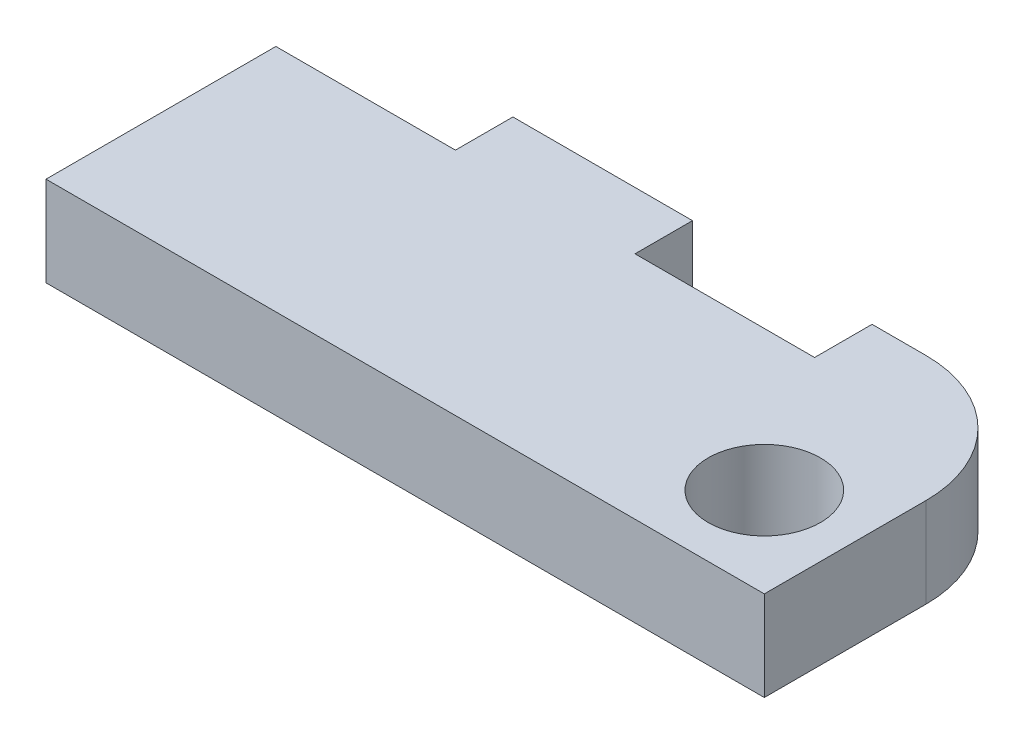
ISO-10303-21;
HEADER;
FILE_DESCRIPTION(('STEP AP214'),'2;1');
FILE_NAME('part.step','',(''),(''),'','','');
FILE_SCHEMA(('AUTOMOTIVE_DESIGN { 1 0 10303 214 1 1 1 1 }'));
ENDSEC;
DATA;
#1=APPLICATION_CONTEXT('core data for automotive mechanical design processes');
#2=APPLICATION_PROTOCOL_DEFINITION('international standard','automotive_design',2000,#1);
#3=PRODUCT_CONTEXT('',#1,'mechanical');
#4=PRODUCT('Part','Part','',(#3));
#5=PRODUCT_RELATED_PRODUCT_CATEGORY('part','',(#4));
#6=PRODUCT_DEFINITION_FORMATION('','',#4);
#7=PRODUCT_DEFINITION_CONTEXT('part definition',#1,'design');
#8=PRODUCT_DEFINITION('design','',#6,#7);
#9=PRODUCT_DEFINITION_SHAPE('','',#8);
#10=(LENGTH_UNIT() NAMED_UNIT(*) SI_UNIT(.MILLI.,.METRE.));
#11=(NAMED_UNIT(*) PLANE_ANGLE_UNIT() SI_UNIT($,.RADIAN.));
#12=(NAMED_UNIT(*) SI_UNIT($,.STERADIAN.) SOLID_ANGLE_UNIT());
#13=UNCERTAINTY_MEASURE_WITH_UNIT(LENGTH_MEASURE(1.E-05),#10,'distance_accuracy_value','');
#14=(GEOMETRIC_REPRESENTATION_CONTEXT(3) GLOBAL_UNCERTAINTY_ASSIGNED_CONTEXT((#13)) GLOBAL_UNIT_ASSIGNED_CONTEXT((#10,
#11,#12)) REPRESENTATION_CONTEXT('',''));
#15=CARTESIAN_POINT('',(0.,0.,0.));
#16=DIRECTION('',(0.,0.,1.));
#17=DIRECTION('',(1.,0.,0.));
#18=AXIS2_PLACEMENT_3D('',#15,#16,#17);
#19=CARTESIAN_POINT('',(0.,0.,-6.));
#20=DIRECTION('',(0.,0.,-1.));
#21=DIRECTION('',(-1.,0.,0.));
#22=AXIS2_PLACEMENT_3D('',#19,#20,#21);
#23=PLANE('',#22);
#24=DIRECTION('',(0.,1.,0.));
#25=VECTOR('',#24,1.);
#26=CARTESIAN_POINT('',(20.,-5.,-6.));
#27=LINE('',#26,#25);
#28=CARTESIAN_POINT('',(20.,-5.,-6.));
#29=VERTEX_POINT('',#28);
#30=CARTESIAN_POINT('',(20.,0.,-6.));
#31=VERTEX_POINT('',#30);
#32=EDGE_CURVE('E122',#29,#31,#27,.T.);
#33=ORIENTED_EDGE('',*,*,#32,.F.);
#34=DIRECTION('',(-1.,0.,0.));
#35=VECTOR('',#34,1.);
#36=CARTESIAN_POINT('',(0.,-5.,-6.));
#37=LINE('',#36,#35);
#38=CARTESIAN_POINT('',(10.,-5.,-6.));
#39=VERTEX_POINT('',#38);
#40=EDGE_CURVE('E172',#29,#39,#37,.T.);
#41=ORIENTED_EDGE('',*,*,#40,.T.);
#42=DIRECTION('',(0.,-1.,0.));
#43=VECTOR('',#42,1.);
#44=CARTESIAN_POINT('',(10.,-5.,-6.));
#45=LINE('',#44,#43);
#46=CARTESIAN_POINT('',(10.,0.,-6.));
#47=VERTEX_POINT('',#46);
#48=EDGE_CURVE('E149',#47,#39,#45,.T.);
#49=ORIENTED_EDGE('',*,*,#48,.F.);
#50=DIRECTION('',(1.,0.,0.));
#51=VECTOR('',#50,1.);
#52=CARTESIAN_POINT('',(0.,0.,-6.));
#53=LINE('',#52,#51);
#54=EDGE_CURVE('E170',#47,#31,#53,.T.);
#55=ORIENTED_EDGE('',*,*,#54,.T.);
#56=EDGE_LOOP('',(#33,#41,#49,#55));
#57=FACE_BOUND('',#56,.T.);
#58=ADVANCED_FACE('F33',(#57),#23,.T.);
#59=CARTESIAN_POINT('',(0.,0.,10.));
#60=DIRECTION('',(1.,0.,0.));
#61=DIRECTION('',(0.,1.,0.));
#62=AXIS2_PLACEMENT_3D('',#59,#60,#61);
#63=PLANE('',#62);
#64=DIRECTION('',(0.,1.,0.));
#65=VECTOR('',#64,1.);
#66=CARTESIAN_POINT('',(0.,-5.,-2.8));
#67=LINE('',#66,#65);
#68=CARTESIAN_POINT('',(0.,-5.,-2.8));
#69=VERTEX_POINT('',#68);
#70=CARTESIAN_POINT('',(0.,0.,-2.8));
#71=VERTEX_POINT('',#70);
#72=EDGE_CURVE('E154',#69,#71,#67,.T.);
#73=ORIENTED_EDGE('',*,*,#72,.F.);
#74=DIRECTION('',(0.,0.,-1.));
#75=VECTOR('',#74,1.);
#76=CARTESIAN_POINT('',(0.,-5.,10.));
#77=LINE('',#76,#75);
#78=CARTESIAN_POINT('',(0.,-5.,10.));
#79=VERTEX_POINT('',#78);
#80=EDGE_CURVE('E200',#79,#69,#77,.T.);
#81=ORIENTED_EDGE('',*,*,#80,.F.);
#82=DIRECTION('',(0.,-1.,0.));
#83=VECTOR('',#82,1.);
#84=CARTESIAN_POINT('',(0.,0.,10.));
#85=LINE('',#84,#83);
#86=CARTESIAN_POINT('',(0.,0.,10.));
#87=VERTEX_POINT('',#86);
#88=EDGE_CURVE('E180',#87,#79,#85,.T.);
#89=ORIENTED_EDGE('',*,*,#88,.F.);
#90=DIRECTION('',(0.,0.,-1.));
#91=VECTOR('',#90,1.);
#92=CARTESIAN_POINT('',(0.,0.,10.));
#93=LINE('',#92,#91);
#94=EDGE_CURVE('E191',#87,#71,#93,.T.);
#95=ORIENTED_EDGE('',*,*,#94,.T.);
#96=EDGE_LOOP('',(#73,#81,#89,#95));
#97=FACE_BOUND('',#96,.T.);
#98=ADVANCED_FACE('F236',(#97),#63,.F.);
#99=CARTESIAN_POINT('',(0.,-5.,10.));
#100=DIRECTION('',(0.,1.,0.));
#101=DIRECTION('',(0.,0.,1.));
#102=AXIS2_PLACEMENT_3D('',#99,#100,#101);
#103=PLANE('',#102);
#104=ORIENTED_EDGE('',*,*,#40,.F.);
#105=DIRECTION('',(0.,0.,-1.));
#106=VECTOR('',#105,1.);
#107=CARTESIAN_POINT('',(20.,-5.,-2.8));
#108=LINE('',#107,#106);
#109=CARTESIAN_POINT('',(20.,-5.,-2.8));
#110=VERTEX_POINT('',#109);
#111=EDGE_CURVE('E147',#110,#29,#108,.T.);
#112=ORIENTED_EDGE('',*,*,#111,.F.);
#113=DIRECTION('',(-1.,0.,0.));
#114=VECTOR('',#113,1.);
#115=CARTESIAN_POINT('',(20.,-5.,-2.8));
#116=LINE('',#115,#114);
#117=CARTESIAN_POINT('',(30.,-5.,-2.8));
#118=VERTEX_POINT('',#117);
#119=EDGE_CURVE('E127',#118,#110,#116,.T.);
#120=ORIENTED_EDGE('',*,*,#119,.F.);
#121=DIRECTION('',(0.,0.,-1.));
#122=VECTOR('',#121,1.);
#123=CARTESIAN_POINT('',(30.,-5.,-2.8));
#124=LINE('',#123,#122);
#125=CARTESIAN_POINT('',(30.,-5.,-6.));
#126=VERTEX_POINT('',#125);
#127=EDGE_CURVE('E150',#118,#126,#124,.T.);
#128=ORIENTED_EDGE('',*,*,#127,.T.);
#129=CARTESIAN_POINT('',(33.,-5.,-6.));
#130=VERTEX_POINT('',#129);
#131=EDGE_CURVE('E173',#130,#126,#37,.T.);
#132=ORIENTED_EDGE('',*,*,#131,.F.);
#133=CARTESIAN_POINT('',(33.,-5.,1.));
#134=DIRECTION('',(0.,1.,0.));
#135=DIRECTION('',(0.,0.,1.));
#136=AXIS2_PLACEMENT_3D('',#133,#134,#135);
#137=CIRCLE('',#136,7.);
#138=CARTESIAN_POINT('',(40.,-5.,0.999999999999999));
#139=VERTEX_POINT('',#138);
#140=EDGE_CURVE('E206',#130,#139,#137,.F.);
#141=ORIENTED_EDGE('',*,*,#140,.T.);
#142=DIRECTION('',(0.,0.,-1.));
#143=VECTOR('',#142,1.);
#144=CARTESIAN_POINT('',(40.,-5.,10.));
#145=LINE('',#144,#143);
#146=CARTESIAN_POINT('',(40.,-5.,10.));
#147=VERTEX_POINT('',#146);
#148=EDGE_CURVE('E197',#147,#139,#145,.T.);
#149=ORIENTED_EDGE('',*,*,#148,.F.);
#150=DIRECTION('',(1.,0.,0.));
#151=VECTOR('',#150,1.);
#152=CARTESIAN_POINT('',(0.,-5.,10.));
#153=LINE('',#152,#151);
#154=EDGE_CURVE('E185',#79,#147,#153,.T.);
#155=ORIENTED_EDGE('',*,*,#154,.F.);
#156=ORIENTED_EDGE('',*,*,#80,.T.);
#157=DIRECTION('',(-1.,0.,0.));
#158=VECTOR('',#157,1.);
#159=CARTESIAN_POINT('',(0.,-5.,-2.8));
#160=LINE('',#159,#158);
#161=CARTESIAN_POINT('',(10.,-5.,-2.8));
#162=VERTEX_POINT('',#161);
#163=EDGE_CURVE('E162',#162,#69,#160,.T.);
#164=ORIENTED_EDGE('',*,*,#163,.F.);
#165=DIRECTION('',(0.,0.,-1.));
#166=VECTOR('',#165,1.);
#167=CARTESIAN_POINT('',(10.,-5.,-2.8));
#168=LINE('',#167,#166);
#169=EDGE_CURVE('E165',#162,#39,#168,.T.);
#170=ORIENTED_EDGE('',*,*,#169,.T.);
#171=EDGE_LOOP('',(#104,#112,#120,#128,#132,#141,#149,#155,#156,#164,#170));
#172=FACE_BOUND('',#171,.T.);
#173=CARTESIAN_POINT('',(35.,-5.,5.));
#174=DIRECTION('',(0.,1.,0.));
#175=DIRECTION('',(0.,0.,1.));
#176=AXIS2_PLACEMENT_3D('',#173,#174,#175);
#177=CIRCLE('',#176,3.125);
#178=CARTESIAN_POINT('',(35.,-5.,8.125));
#179=VERTEX_POINT('',#178);
#180=EDGE_CURVE('E177',#179,#179,#177,.T.);
#181=ORIENTED_EDGE('',*,*,#180,.T.);
#182=EDGE_LOOP('',(#181));
#183=FACE_BOUND('',#182,.T.);
#184=ADVANCED_FACE('F223',(#172,#183),#103,.F.);
#185=CARTESIAN_POINT('',(40.,0.,10.));
#186=DIRECTION('',(-1.,0.,0.));
#187=DIRECTION('',(0.,0.,1.));
#188=AXIS2_PLACEMENT_3D('',#185,#186,#187);
#189=PLANE('',#188);
#190=ORIENTED_EDGE('',*,*,#148,.T.);
#191=DIRECTION('',(0.,-1.,0.));
#192=VECTOR('',#191,1.);
#193=CARTESIAN_POINT('',(40.,0.,1.));
#194=LINE('',#193,#192);
#195=CARTESIAN_POINT('',(40.,0.,0.999999999999999));
#196=VERTEX_POINT('',#195);
#197=EDGE_CURVE('E41',#139,#196,#194,.F.);
#198=ORIENTED_EDGE('',*,*,#197,.T.);
#199=DIRECTION('',(0.,0.,-1.));
#200=VECTOR('',#199,1.);
#201=CARTESIAN_POINT('',(40.,0.,10.));
#202=LINE('',#201,#200);
#203=CARTESIAN_POINT('',(40.,0.,10.));
#204=VERTEX_POINT('',#203);
#205=EDGE_CURVE('E194',#204,#196,#202,.T.);
#206=ORIENTED_EDGE('',*,*,#205,.F.);
#207=DIRECTION('',(0.,1.,0.));
#208=VECTOR('',#207,1.);
#209=CARTESIAN_POINT('',(40.,0.,10.));
#210=LINE('',#209,#208);
#211=EDGE_CURVE('E187',#147,#204,#210,.T.);
#212=ORIENTED_EDGE('',*,*,#211,.F.);
#213=EDGE_LOOP('',(#190,#198,#206,#212));
#214=FACE_BOUND('',#213,.T.);
#215=ADVANCED_FACE('F210',(#214),#189,.F.);
#216=CARTESIAN_POINT('',(0.,0.,10.));
#217=DIRECTION('',(0.,-1.,0.));
#218=DIRECTION('',(0.,0.,-1.));
#219=AXIS2_PLACEMENT_3D('',#216,#217,#218);
#220=PLANE('',#219);
#221=CARTESIAN_POINT('',(35.,0.,5.));
#222=DIRECTION('',(0.,1.,0.));
#223=DIRECTION('',(0.,0.,1.));
#224=AXIS2_PLACEMENT_3D('',#221,#222,#223);
#225=CIRCLE('',#224,3.125);
#226=CARTESIAN_POINT('',(35.,0.,8.125));
#227=VERTEX_POINT('',#226);
#228=EDGE_CURVE('E176',#227,#227,#225,.T.);
#229=ORIENTED_EDGE('',*,*,#228,.F.);
#230=EDGE_LOOP('',(#229));
#231=FACE_BOUND('',#230,.T.);
#232=DIRECTION('',(1.,0.,0.));
#233=VECTOR('',#232,1.);
#234=CARTESIAN_POINT('',(20.,0.,-2.8));
#235=LINE('',#234,#233);
#236=CARTESIAN_POINT('',(20.,0.,-2.8));
#237=VERTEX_POINT('',#236);
#238=CARTESIAN_POINT('',(30.,0.,-2.8));
#239=VERTEX_POINT('',#238);
#240=EDGE_CURVE('E133',#237,#239,#235,.T.);
#241=ORIENTED_EDGE('',*,*,#240,.F.);
#242=DIRECTION('',(0.,0.,-1.));
#243=VECTOR('',#242,1.);
#244=CARTESIAN_POINT('',(20.,0.,-2.8));
#245=LINE('',#244,#243);
#246=EDGE_CURVE('E116',#237,#31,#245,.T.);
#247=ORIENTED_EDGE('',*,*,#246,.T.);
#248=ORIENTED_EDGE('',*,*,#54,.F.);
#249=DIRECTION('',(0.,0.,-1.));
#250=VECTOR('',#249,1.);
#251=CARTESIAN_POINT('',(10.,0.,-2.8));
#252=LINE('',#251,#250);
#253=CARTESIAN_POINT('',(10.,0.,-2.8));
#254=VERTEX_POINT('',#253);
#255=EDGE_CURVE('E56',#254,#47,#252,.T.);
#256=ORIENTED_EDGE('',*,*,#255,.F.);
#257=DIRECTION('',(1.,0.,0.));
#258=VECTOR('',#257,1.);
#259=CARTESIAN_POINT('',(0.,0.,-2.8));
#260=LINE('',#259,#258);
#261=EDGE_CURVE('E156',#71,#254,#260,.T.);
#262=ORIENTED_EDGE('',*,*,#261,.F.);
#263=ORIENTED_EDGE('',*,*,#94,.F.);
#264=DIRECTION('',(-1.,0.,0.));
#265=VECTOR('',#264,1.);
#266=CARTESIAN_POINT('',(0.,0.,10.));
#267=LINE('',#266,#265);
#268=EDGE_CURVE('E189',#204,#87,#267,.T.);
#269=ORIENTED_EDGE('',*,*,#268,.F.);
#270=ORIENTED_EDGE('',*,*,#205,.T.);
#271=CARTESIAN_POINT('',(33.,0.,1.));
#272=DIRECTION('',(0.,-1.,0.));
#273=DIRECTION('',(0.,0.,-1.));
#274=AXIS2_PLACEMENT_3D('',#271,#272,#273);
#275=CIRCLE('',#274,7.);
#276=CARTESIAN_POINT('',(33.,0.,-6.));
#277=VERTEX_POINT('',#276);
#278=EDGE_CURVE('E11',#196,#277,#275,.F.);
#279=ORIENTED_EDGE('',*,*,#278,.T.);
#280=CARTESIAN_POINT('',(30.,0.,-6.));
#281=VERTEX_POINT('',#280);
#282=EDGE_CURVE('E168',#281,#277,#53,.T.);
#283=ORIENTED_EDGE('',*,*,#282,.F.);
#284=DIRECTION('',(0.,0.,-1.));
#285=VECTOR('',#284,1.);
#286=CARTESIAN_POINT('',(30.,0.,-2.8));
#287=LINE('',#286,#285);
#288=EDGE_CURVE('E48',#239,#281,#287,.T.);
#289=ORIENTED_EDGE('',*,*,#288,.F.);
#290=EDGE_LOOP('',(#241,#247,#248,#256,#262,#263,#269,#270,#279,#283,#289));
#291=FACE_BOUND('',#290,.T.);
#292=ADVANCED_FACE('F138',(#231,#291),#220,.F.);
#293=CARTESIAN_POINT('',(0.,0.,10.));
#294=DIRECTION('',(0.,0.,1.));
#295=DIRECTION('',(1.,0.,0.));
#296=AXIS2_PLACEMENT_3D('',#293,#294,#295);
#297=PLANE('',#296);
#298=ORIENTED_EDGE('',*,*,#88,.T.);
#299=ORIENTED_EDGE('',*,*,#154,.T.);
#300=ORIENTED_EDGE('',*,*,#211,.T.);
#301=ORIENTED_EDGE('',*,*,#268,.T.);
#302=EDGE_LOOP('',(#298,#299,#300,#301));
#303=FACE_BOUND('',#302,.T.);
#304=ADVANCED_FACE('F252',(#303),#297,.T.);
#305=CARTESIAN_POINT('',(35.,-5.,5.));
#306=DIRECTION('',(0.,1.,0.));
#307=DIRECTION('',(0.,0.,1.));
#308=AXIS2_PLACEMENT_3D('',#305,#306,#307);
#309=CYLINDRICAL_SURFACE('',#308,3.125);
#310=ORIENTED_EDGE('',*,*,#180,.F.);
#311=EDGE_LOOP('',(#310));
#312=FACE_BOUND('',#311,.T.);
#313=ORIENTED_EDGE('',*,*,#228,.T.);
#314=EDGE_LOOP('',(#313));
#315=FACE_BOUND('',#314,.T.);
#316=ADVANCED_FACE('F246',(#312,#315),#309,.F.);
#317=DIRECTION('',(0.,-1.,0.));
#318=VECTOR('',#317,1.);
#319=CARTESIAN_POINT('',(30.,-5.,-6.));
#320=LINE('',#319,#318);
#321=EDGE_CURVE('E136',#281,#126,#320,.T.);
#322=ORIENTED_EDGE('',*,*,#321,.F.);
#323=ORIENTED_EDGE('',*,*,#282,.T.);
#324=DIRECTION('',(0.,-1.,0.));
#325=VECTOR('',#324,1.);
#326=CARTESIAN_POINT('',(33.,-5.,-6.));
#327=LINE('',#326,#325);
#328=EDGE_CURVE('E203',#277,#130,#327,.T.);
#329=ORIENTED_EDGE('',*,*,#328,.T.);
#330=ORIENTED_EDGE('',*,*,#131,.T.);
#331=EDGE_LOOP('',(#322,#323,#329,#330));
#332=FACE_BOUND('',#331,.T.);
#333=ADVANCED_FACE('F220',(#332),#23,.T.);
#334=CARTESIAN_POINT('',(33.,0.,1.));
#335=DIRECTION('',(0.,1.,0.));
#336=DIRECTION('',(0.,0.,1.));
#337=AXIS2_PLACEMENT_3D('',#334,#335,#336);
#338=CYLINDRICAL_SURFACE('',#337,7.);
#339=ORIENTED_EDGE('',*,*,#278,.F.);
#340=ORIENTED_EDGE('',*,*,#197,.F.);
#341=ORIENTED_EDGE('',*,*,#140,.F.);
#342=ORIENTED_EDGE('',*,*,#328,.F.);
#343=EDGE_LOOP('',(#339,#340,#341,#342));
#344=FACE_BOUND('',#343,.T.);
#345=ADVANCED_FACE('F35',(#344),#338,.T.);
#346=CARTESIAN_POINT('',(10.,-5.,-2.8));
#347=DIRECTION('',(1.,0.,0.));
#348=DIRECTION('',(0.,0.,-1.));
#349=AXIS2_PLACEMENT_3D('',#346,#347,#348);
#350=PLANE('',#349);
#351=ORIENTED_EDGE('',*,*,#48,.T.);
#352=ORIENTED_EDGE('',*,*,#169,.F.);
#353=DIRECTION('',(0.,-1.,0.));
#354=VECTOR('',#353,1.);
#355=CARTESIAN_POINT('',(10.,-5.,-2.8));
#356=LINE('',#355,#354);
#357=EDGE_CURVE('E159',#254,#162,#356,.T.);
#358=ORIENTED_EDGE('',*,*,#357,.F.);
#359=ORIENTED_EDGE('',*,*,#255,.T.);
#360=EDGE_LOOP('',(#351,#352,#358,#359));
#361=FACE_BOUND('',#360,.T.);
#362=ADVANCED_FACE('F251',(#361),#350,.F.);
#363=CARTESIAN_POINT('',(0.,0.,-2.8));
#364=DIRECTION('',(0.,0.,-1.));
#365=DIRECTION('',(-1.,0.,0.));
#366=AXIS2_PLACEMENT_3D('',#363,#364,#365);
#367=PLANE('',#366);
#368=ORIENTED_EDGE('',*,*,#72,.T.);
#369=ORIENTED_EDGE('',*,*,#261,.T.);
#370=ORIENTED_EDGE('',*,*,#357,.T.);
#371=ORIENTED_EDGE('',*,*,#163,.T.);
#372=EDGE_LOOP('',(#368,#369,#370,#371));
#373=FACE_BOUND('',#372,.T.);
#374=ADVANCED_FACE('F233',(#373),#367,.T.);
#375=CARTESIAN_POINT('',(20.,-5.,-2.8));
#376=DIRECTION('',(-1.,0.,0.));
#377=DIRECTION('',(0.,0.,1.));
#378=AXIS2_PLACEMENT_3D('',#375,#376,#377);
#379=PLANE('',#378);
#380=ORIENTED_EDGE('',*,*,#32,.T.);
#381=ORIENTED_EDGE('',*,*,#246,.F.);
#382=DIRECTION('',(0.,1.,0.));
#383=VECTOR('',#382,1.);
#384=CARTESIAN_POINT('',(20.,-5.,-2.8));
#385=LINE('',#384,#383);
#386=EDGE_CURVE('E119',#110,#237,#385,.T.);
#387=ORIENTED_EDGE('',*,*,#386,.F.);
#388=ORIENTED_EDGE('',*,*,#111,.T.);
#389=EDGE_LOOP('',(#380,#381,#387,#388));
#390=FACE_BOUND('',#389,.T.);
#391=ADVANCED_FACE('F118',(#390),#379,.F.);
#392=CARTESIAN_POINT('',(30.,-5.,-2.8));
#393=DIRECTION('',(1.,0.,0.));
#394=DIRECTION('',(0.,0.,-1.));
#395=AXIS2_PLACEMENT_3D('',#392,#393,#394);
#396=PLANE('',#395);
#397=ORIENTED_EDGE('',*,*,#321,.T.);
#398=ORIENTED_EDGE('',*,*,#127,.F.);
#399=DIRECTION('',(0.,-1.,0.));
#400=VECTOR('',#399,1.);
#401=CARTESIAN_POINT('',(30.,-5.,-2.8));
#402=LINE('',#401,#400);
#403=EDGE_CURVE('E140',#239,#118,#402,.T.);
#404=ORIENTED_EDGE('',*,*,#403,.F.);
#405=ORIENTED_EDGE('',*,*,#288,.T.);
#406=EDGE_LOOP('',(#397,#398,#404,#405));
#407=FACE_BOUND('',#406,.T.);
#408=ADVANCED_FACE('F225',(#407),#396,.F.);
#409=CARTESIAN_POINT('',(20.,0.,-2.8));
#410=DIRECTION('',(0.,0.,-1.));
#411=DIRECTION('',(-1.,0.,0.));
#412=AXIS2_PLACEMENT_3D('',#409,#410,#411);
#413=PLANE('',#412);
#414=ORIENTED_EDGE('',*,*,#386,.T.);
#415=ORIENTED_EDGE('',*,*,#240,.T.);
#416=ORIENTED_EDGE('',*,*,#403,.T.);
#417=ORIENTED_EDGE('',*,*,#119,.T.);
#418=EDGE_LOOP('',(#414,#415,#416,#417));
#419=FACE_BOUND('',#418,.T.);
#420=ADVANCED_FACE('F131',(#419),#413,.T.);
#421=CLOSED_SHELL('',(#58,#98,#184,#215,#292,#304,#316,#333,#345,#362,#374,#391,#408,#420));
#422=MANIFOLD_SOLID_BREP('B2',#421);
#423=ADVANCED_BREP_SHAPE_REPRESENTATION('',(#18,#422),#14);
#424=SHAPE_DEFINITION_REPRESENTATION(#9,#423);
ENDSEC;
END-ISO-10303-21;
